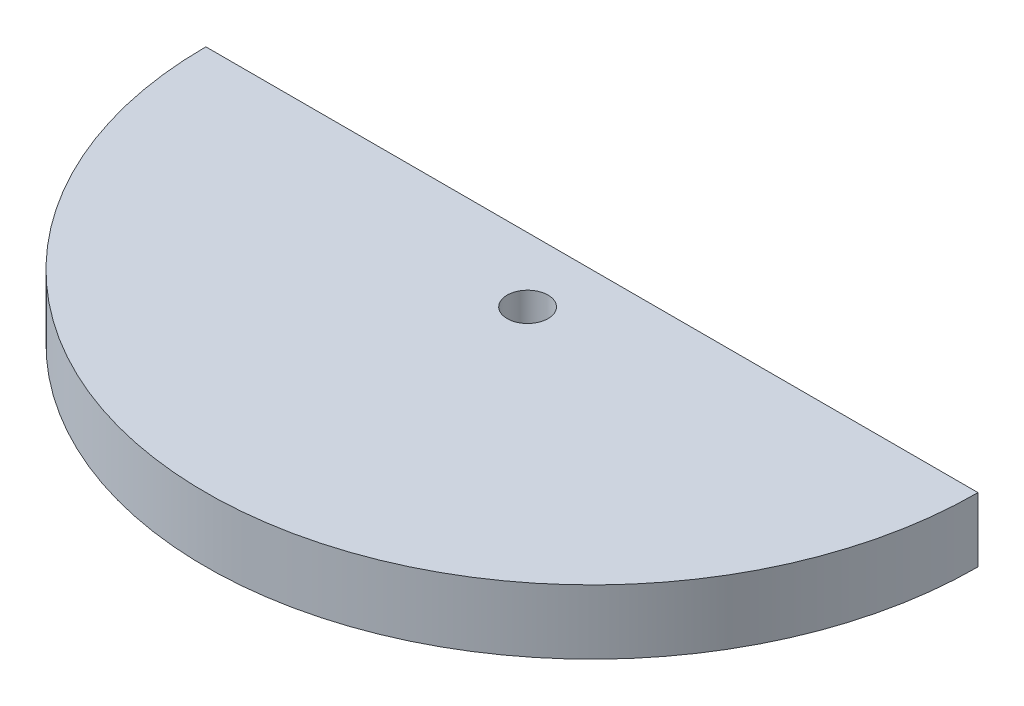
ISO-10303-21;
HEADER;
FILE_DESCRIPTION(('STEP AP214'),'2;1');
FILE_NAME('part.step','',(''),(''),'','','');
FILE_SCHEMA(('AUTOMOTIVE_DESIGN { 1 0 10303 214 1 1 1 1 }'));
ENDSEC;
DATA;
#1=APPLICATION_CONTEXT('core data for automotive mechanical design processes');
#2=APPLICATION_PROTOCOL_DEFINITION('international standard','automotive_design',2000,#1);
#3=PRODUCT_CONTEXT('',#1,'mechanical');
#4=PRODUCT('Part','Part','',(#3));
#5=PRODUCT_RELATED_PRODUCT_CATEGORY('part','',(#4));
#6=PRODUCT_DEFINITION_FORMATION('','',#4);
#7=PRODUCT_DEFINITION_CONTEXT('part definition',#1,'design');
#8=PRODUCT_DEFINITION('design','',#6,#7);
#9=PRODUCT_DEFINITION_SHAPE('','',#8);
#10=(LENGTH_UNIT() NAMED_UNIT(*) SI_UNIT(.MILLI.,.METRE.));
#11=(NAMED_UNIT(*) PLANE_ANGLE_UNIT() SI_UNIT($,.RADIAN.));
#12=(NAMED_UNIT(*) SI_UNIT($,.STERADIAN.) SOLID_ANGLE_UNIT());
#13=UNCERTAINTY_MEASURE_WITH_UNIT(LENGTH_MEASURE(1.E-05),#10,'distance_accuracy_value','');
#14=(GEOMETRIC_REPRESENTATION_CONTEXT(3) GLOBAL_UNCERTAINTY_ASSIGNED_CONTEXT((#13)) GLOBAL_UNIT_ASSIGNED_CONTEXT((#10,
#11,#12)) REPRESENTATION_CONTEXT('',''));
#15=CARTESIAN_POINT('',(0.,0.,0.));
#16=DIRECTION('',(0.,0.,1.));
#17=DIRECTION('',(1.,0.,0.));
#18=AXIS2_PLACEMENT_3D('',#15,#16,#17);
#19=CARTESIAN_POINT('',(0.,5.,0.));
#20=DIRECTION('',(0.,1.,0.));
#21=DIRECTION('',(0.,0.,1.));
#22=AXIS2_PLACEMENT_3D('',#19,#20,#21);
#23=PLANE('',#22);
#24=CARTESIAN_POINT('',(0.,5.,0.));
#25=DIRECTION('',(0.,1.,0.));
#26=DIRECTION('',(0.,0.,1.));
#27=AXIS2_PLACEMENT_3D('',#24,#25,#26);
#28=CIRCLE('',#27,30.);
#29=CARTESIAN_POINT('',(-30.,5.,0.));
#30=VERTEX_POINT('',#29);
#31=CARTESIAN_POINT('',(30.,5.,0.));
#32=VERTEX_POINT('',#31);
#33=EDGE_CURVE('E64',#30,#32,#28,.T.);
#34=ORIENTED_EDGE('',*,*,#33,.T.);
#35=DIRECTION('',(-1.,0.,0.));
#36=VECTOR('',#35,1.);
#37=CARTESIAN_POINT('',(-30.,5.,0.));
#38=LINE('',#37,#36);
#39=EDGE_CURVE('E49',#32,#30,#38,.T.);
#40=ORIENTED_EDGE('',*,*,#39,.T.);
#41=EDGE_LOOP('',(#34,#40));
#42=FACE_BOUND('',#41,.T.);
#43=CARTESIAN_POINT('',(0.,5.,5.));
#44=DIRECTION('',(0.,1.,0.));
#45=DIRECTION('',(0.,0.,1.));
#46=AXIS2_PLACEMENT_3D('',#43,#44,#45);
#47=CIRCLE('',#46,1.5875);
#48=CARTESIAN_POINT('',(0.,5.,6.5875));
#49=VERTEX_POINT('',#48);
#50=EDGE_CURVE('E70',#49,#49,#47,.T.);
#51=ORIENTED_EDGE('',*,*,#50,.F.);
#52=EDGE_LOOP('',(#51));
#53=FACE_BOUND('',#52,.T.);
#54=ADVANCED_FACE('F33',(#42,#53),#23,.T.);
#55=CARTESIAN_POINT('',(0.,0.,0.));
#56=DIRECTION('',(0.,1.,0.));
#57=DIRECTION('',(0.,0.,1.));
#58=AXIS2_PLACEMENT_3D('',#55,#56,#57);
#59=PLANE('',#58);
#60=CARTESIAN_POINT('',(0.,0.,0.));
#61=DIRECTION('',(0.,1.,0.));
#62=DIRECTION('',(0.,0.,1.));
#63=AXIS2_PLACEMENT_3D('',#60,#61,#62);
#64=CIRCLE('',#63,30.);
#65=CARTESIAN_POINT('',(-30.,0.,0.));
#66=VERTEX_POINT('',#65);
#67=CARTESIAN_POINT('',(30.,0.,0.));
#68=VERTEX_POINT('',#67);
#69=EDGE_CURVE('E65',#66,#68,#64,.T.);
#70=ORIENTED_EDGE('',*,*,#69,.F.);
#71=DIRECTION('',(-1.,0.,0.));
#72=VECTOR('',#71,1.);
#73=CARTESIAN_POINT('',(-30.,0.,0.));
#74=LINE('',#73,#72);
#75=EDGE_CURVE('E57',#68,#66,#74,.T.);
#76=ORIENTED_EDGE('',*,*,#75,.F.);
#77=EDGE_LOOP('',(#70,#76));
#78=FACE_BOUND('',#77,.T.);
#79=CARTESIAN_POINT('',(0.,0.,5.));
#80=DIRECTION('',(0.,1.,0.));
#81=DIRECTION('',(0.,0.,1.));
#82=AXIS2_PLACEMENT_3D('',#79,#80,#81);
#83=CIRCLE('',#82,1.5875);
#84=CARTESIAN_POINT('',(0.,0.,6.5875));
#85=VERTEX_POINT('',#84);
#86=EDGE_CURVE('E73',#85,#85,#83,.T.);
#87=ORIENTED_EDGE('',*,*,#86,.T.);
#88=EDGE_LOOP('',(#87));
#89=FACE_BOUND('',#88,.T.);
#90=ADVANCED_FACE('F68',(#78,#89),#59,.F.);
#91=CARTESIAN_POINT('',(0.,5.,0.));
#92=DIRECTION('',(0.,-1.,0.));
#93=DIRECTION('',(0.,0.,-1.));
#94=AXIS2_PLACEMENT_3D('',#91,#92,#93);
#95=CYLINDRICAL_SURFACE('',#94,30.);
#96=ORIENTED_EDGE('',*,*,#69,.T.);
#97=DIRECTION('',(0.,-1.,0.));
#98=VECTOR('',#97,1.);
#99=CARTESIAN_POINT('',(30.,5.,0.));
#100=LINE('',#99,#98);
#101=EDGE_CURVE('E11',#32,#68,#100,.T.);
#102=ORIENTED_EDGE('',*,*,#101,.F.);
#103=ORIENTED_EDGE('',*,*,#33,.F.);
#104=DIRECTION('',(0.,-1.,0.));
#105=VECTOR('',#104,1.);
#106=CARTESIAN_POINT('',(-30.,5.,0.));
#107=LINE('',#106,#105);
#108=EDGE_CURVE('E42',#30,#66,#107,.T.);
#109=ORIENTED_EDGE('',*,*,#108,.T.);
#110=EDGE_LOOP('',(#96,#102,#103,#109));
#111=FACE_BOUND('',#110,.T.);
#112=ADVANCED_FACE('F35',(#111),#95,.T.);
#113=CARTESIAN_POINT('',(-30.,5.,0.));
#114=DIRECTION('',(0.,0.,1.));
#115=DIRECTION('',(1.,0.,0.));
#116=AXIS2_PLACEMENT_3D('',#113,#114,#115);
#117=PLANE('',#116);
#118=ORIENTED_EDGE('',*,*,#75,.T.);
#119=ORIENTED_EDGE('',*,*,#108,.F.);
#120=ORIENTED_EDGE('',*,*,#39,.F.);
#121=ORIENTED_EDGE('',*,*,#101,.T.);
#122=EDGE_LOOP('',(#118,#119,#120,#121));
#123=FACE_BOUND('',#122,.T.);
#124=ADVANCED_FACE('F60',(#123),#117,.F.);
#125=CARTESIAN_POINT('',(0.,5.,5.));
#126=DIRECTION('',(0.,-1.,0.));
#127=DIRECTION('',(0.,0.,-1.));
#128=AXIS2_PLACEMENT_3D('',#125,#126,#127);
#129=CYLINDRICAL_SURFACE('',#128,1.5875);
#130=ORIENTED_EDGE('',*,*,#50,.T.);
#131=EDGE_LOOP('',(#130));
#132=FACE_BOUND('',#131,.T.);
#133=ORIENTED_EDGE('',*,*,#86,.F.);
#134=EDGE_LOOP('',(#133));
#135=FACE_BOUND('',#134,.T.);
#136=ADVANCED_FACE('F81',(#132,#135),#129,.F.);
#137=CLOSED_SHELL('',(#54,#90,#112,#124,#136));
#138=MANIFOLD_SOLID_BREP('B2',#137);
#139=ADVANCED_BREP_SHAPE_REPRESENTATION('',(#18,#138),#14);
#140=SHAPE_DEFINITION_REPRESENTATION(#9,#139);
ENDSEC;
END-ISO-10303-21;
